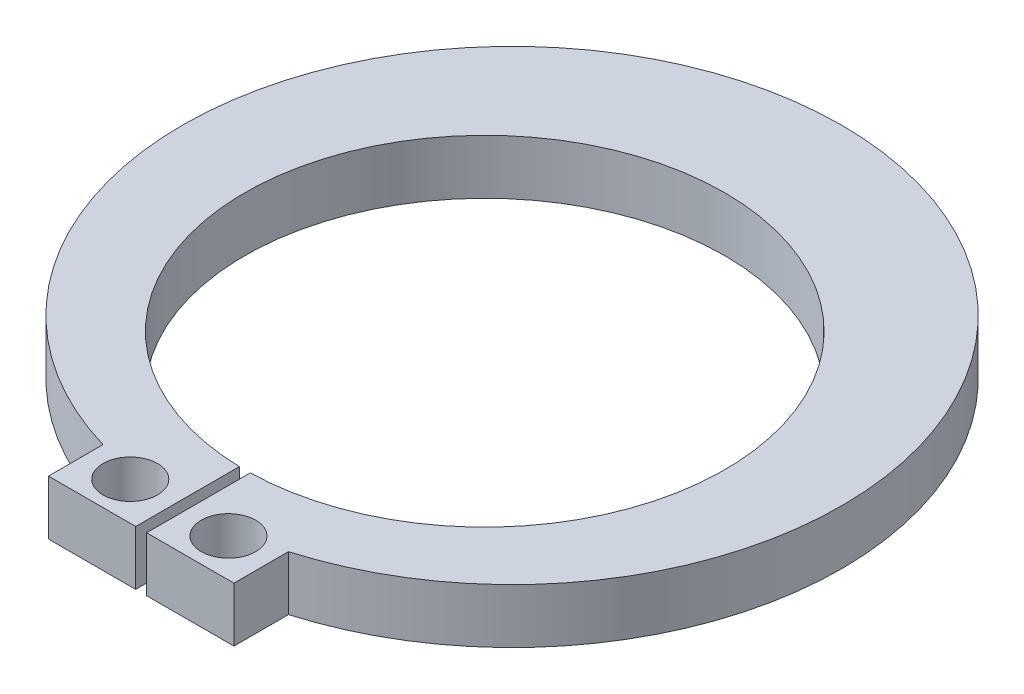
ISO-10303-21;
HEADER;
FILE_DESCRIPTION(('STEP AP214'),'2;1');
FILE_NAME('part.step','',(''),(''),'','','');
FILE_SCHEMA(('AUTOMOTIVE_DESIGN { 1 0 10303 214 1 1 1 1 }'));
ENDSEC;
DATA;
#1=APPLICATION_CONTEXT('core data for automotive mechanical design processes');
#2=APPLICATION_PROTOCOL_DEFINITION('international standard','automotive_design',2000,#1);
#3=PRODUCT_CONTEXT('',#1,'mechanical');
#4=PRODUCT('Part','Part','',(#3));
#5=PRODUCT_RELATED_PRODUCT_CATEGORY('part','',(#4));
#6=PRODUCT_DEFINITION_FORMATION('','',#4);
#7=PRODUCT_DEFINITION_CONTEXT('part definition',#1,'design');
#8=PRODUCT_DEFINITION('design','',#6,#7);
#9=PRODUCT_DEFINITION_SHAPE('','',#8);
#10=(LENGTH_UNIT() NAMED_UNIT(*) SI_UNIT(.MILLI.,.METRE.));
#11=(NAMED_UNIT(*) PLANE_ANGLE_UNIT() SI_UNIT($,.RADIAN.));
#12=(NAMED_UNIT(*) SI_UNIT($,.STERADIAN.) SOLID_ANGLE_UNIT());
#13=UNCERTAINTY_MEASURE_WITH_UNIT(LENGTH_MEASURE(1.E-05),#10,'distance_accuracy_value','');
#14=(GEOMETRIC_REPRESENTATION_CONTEXT(3) GLOBAL_UNCERTAINTY_ASSIGNED_CONTEXT((#13)) GLOBAL_UNIT_ASSIGNED_CONTEXT((#10,
#11,#12)) REPRESENTATION_CONTEXT('',''));
#15=CARTESIAN_POINT('',(0.,0.,0.));
#16=DIRECTION('',(0.,0.,1.));
#17=DIRECTION('',(1.,0.,0.));
#18=AXIS2_PLACEMENT_3D('',#15,#16,#17);
#19=CARTESIAN_POINT('',(0.,1.,0.));
#20=DIRECTION('',(0.,1.,0.));
#21=DIRECTION('',(0.,0.,1.));
#22=AXIS2_PLACEMENT_3D('',#19,#20,#21);
#23=PLANE('',#22);
#24=CARTESIAN_POINT('',(-0.9,1.,6.1));
#25=DIRECTION('',(0.,1.,0.));
#26=DIRECTION('',(0.,0.,1.));
#27=AXIS2_PLACEMENT_3D('',#24,#25,#26);
#28=CIRCLE('',#27,0.5);
#29=CARTESIAN_POINT('',(-0.9,1.,6.6));
#30=VERTEX_POINT('',#29);
#31=EDGE_CURVE('E133',#30,#30,#28,.T.);
#32=ORIENTED_EDGE('',*,*,#31,.F.);
#33=EDGE_LOOP('',(#32));
#34=FACE_BOUND('',#33,.T.);
#35=DIRECTION('',(0.,0.,1.));
#36=VECTOR('',#35,1.);
#37=CARTESIAN_POINT('',(-1.7,1.,6.8));
#38=LINE('',#37,#36);
#39=CARTESIAN_POINT('',(-1.7,1.,5.8));
#40=VERTEX_POINT('',#39);
#41=CARTESIAN_POINT('',(-1.7,1.,6.8));
#42=VERTEX_POINT('',#41);
#43=EDGE_CURVE('E144',#40,#42,#38,.T.);
#44=ORIENTED_EDGE('',*,*,#43,.T.);
#45=DIRECTION('',(1.,0.,0.));
#46=VECTOR('',#45,1.);
#47=CARTESIAN_POINT('',(-1.7,1.,6.8));
#48=LINE('',#47,#46);
#49=CARTESIAN_POINT('',(-0.1,1.,6.8));
#50=VERTEX_POINT('',#49);
#51=EDGE_CURVE('E92',#42,#50,#48,.T.);
#52=ORIENTED_EDGE('',*,*,#51,.T.);
#53=DIRECTION('',(0.,0.,-1.));
#54=VECTOR('',#53,1.);
#55=CARTESIAN_POINT('',(-0.1,1.,6.8));
#56=LINE('',#55,#54);
#57=CARTESIAN_POINT('',(-0.1,1.,4.89886348958455));
#58=VERTEX_POINT('',#57);
#59=EDGE_CURVE('E159',#50,#58,#56,.T.);
#60=ORIENTED_EDGE('',*,*,#59,.T.);
#61=CARTESIAN_POINT('',(0.,1.,0.5));
#62=DIRECTION('',(0.,-1.,0.));
#63=DIRECTION('',(0.,0.,1.));
#64=AXIS2_PLACEMENT_3D('',#61,#62,#63);
#65=CIRCLE('',#64,4.4);
#66=CARTESIAN_POINT('',(0.1,1.,4.89886348958456));
#67=VERTEX_POINT('',#66);
#68=EDGE_CURVE('E172',#58,#67,#65,.T.);
#69=ORIENTED_EDGE('',*,*,#68,.T.);
#70=DIRECTION('',(0.,0.,1.));
#71=VECTOR('',#70,1.);
#72=CARTESIAN_POINT('',(0.1,1.,6.8));
#73=LINE('',#72,#71);
#74=CARTESIAN_POINT('',(0.1,1.,6.8));
#75=VERTEX_POINT('',#74);
#76=EDGE_CURVE('E111',#67,#75,#73,.T.);
#77=ORIENTED_EDGE('',*,*,#76,.T.);
#78=DIRECTION('',(1.,0.,0.));
#79=VECTOR('',#78,1.);
#80=CARTESIAN_POINT('',(0.1,1.,6.8));
#81=LINE('',#80,#79);
#82=CARTESIAN_POINT('',(1.7,1.,6.8));
#83=VERTEX_POINT('',#82);
#84=EDGE_CURVE('E105',#75,#83,#81,.T.);
#85=ORIENTED_EDGE('',*,*,#84,.T.);
#86=DIRECTION('',(0.,0.,-1.));
#87=VECTOR('',#86,1.);
#88=CARTESIAN_POINT('',(1.7,1.,6.8));
#89=LINE('',#88,#87);
#90=CARTESIAN_POINT('',(1.7,1.,5.8));
#91=VERTEX_POINT('',#90);
#92=EDGE_CURVE('E109',#83,#91,#89,.T.);
#93=ORIENTED_EDGE('',*,*,#92,.T.);
#94=CARTESIAN_POINT('',(0.,1.,0.));
#95=DIRECTION('',(0.,1.,0.));
#96=DIRECTION('',(0.,0.,1.));
#97=AXIS2_PLACEMENT_3D('',#94,#95,#96);
#98=CIRCLE('',#97,6.04400529450463);
#99=EDGE_CURVE('E49',#91,#40,#98,.T.);
#100=ORIENTED_EDGE('',*,*,#99,.T.);
#101=EDGE_LOOP('',(#44,#52,#60,#69,#77,#85,#93,#100));
#102=FACE_BOUND('',#101,.T.);
#103=CARTESIAN_POINT('',(0.9,1.,6.1));
#104=DIRECTION('',(0.,1.,0.));
#105=DIRECTION('',(0.,0.,-1.));
#106=AXIS2_PLACEMENT_3D('',#103,#104,#105);
#107=CIRCLE('',#106,0.5);
#108=CARTESIAN_POINT('',(0.9,1.,5.6));
#109=VERTEX_POINT('',#108);
#110=EDGE_CURVE('E181',#109,#109,#107,.T.);
#111=ORIENTED_EDGE('',*,*,#110,.F.);
#112=EDGE_LOOP('',(#111));
#113=FACE_BOUND('',#112,.T.);
#114=ADVANCED_FACE('F32',(#34,#102,#113),#23,.T.);
#115=CARTESIAN_POINT('',(0.,0.,0.));
#116=DIRECTION('',(0.,1.,0.));
#117=DIRECTION('',(0.,0.,1.));
#118=AXIS2_PLACEMENT_3D('',#115,#116,#117);
#119=PLANE('',#118);
#120=DIRECTION('',(0.,0.,1.));
#121=VECTOR('',#120,1.);
#122=CARTESIAN_POINT('',(-1.7,0.,6.8));
#123=LINE('',#122,#121);
#124=CARTESIAN_POINT('',(-1.7,0.,5.8));
#125=VERTEX_POINT('',#124);
#126=CARTESIAN_POINT('',(-1.7,0.,6.8));
#127=VERTEX_POINT('',#126);
#128=EDGE_CURVE('E129',#125,#127,#123,.T.);
#129=ORIENTED_EDGE('',*,*,#128,.F.);
#130=CARTESIAN_POINT('',(0.,0.,0.));
#131=DIRECTION('',(0.,1.,0.));
#132=DIRECTION('',(0.,0.,1.));
#133=AXIS2_PLACEMENT_3D('',#130,#131,#132);
#134=CIRCLE('',#133,6.04400529450463);
#135=CARTESIAN_POINT('',(1.7,0.,5.8));
#136=VERTEX_POINT('',#135);
#137=EDGE_CURVE('E84',#136,#125,#134,.T.);
#138=ORIENTED_EDGE('',*,*,#137,.F.);
#139=DIRECTION('',(0.,0.,-1.));
#140=VECTOR('',#139,1.);
#141=CARTESIAN_POINT('',(1.7,0.,6.8));
#142=LINE('',#141,#140);
#143=CARTESIAN_POINT('',(1.7,0.,6.8));
#144=VERTEX_POINT('',#143);
#145=EDGE_CURVE('E78',#144,#136,#142,.T.);
#146=ORIENTED_EDGE('',*,*,#145,.F.);
#147=DIRECTION('',(1.,0.,0.));
#148=VECTOR('',#147,1.);
#149=CARTESIAN_POINT('',(0.1,0.,6.8));
#150=LINE('',#149,#148);
#151=CARTESIAN_POINT('',(0.1,0.,6.8));
#152=VERTEX_POINT('',#151);
#153=EDGE_CURVE('E119',#152,#144,#150,.T.);
#154=ORIENTED_EDGE('',*,*,#153,.F.);
#155=DIRECTION('',(0.,0.,1.));
#156=VECTOR('',#155,1.);
#157=CARTESIAN_POINT('',(0.1,0.,6.8));
#158=LINE('',#157,#156);
#159=CARTESIAN_POINT('',(0.1,0.,4.89886348958456));
#160=VERTEX_POINT('',#159);
#161=EDGE_CURVE('E139',#160,#152,#158,.T.);
#162=ORIENTED_EDGE('',*,*,#161,.F.);
#163=CARTESIAN_POINT('',(0.,0.,0.5));
#164=DIRECTION('',(0.,-1.,0.));
#165=DIRECTION('',(0.,0.,1.));
#166=AXIS2_PLACEMENT_3D('',#163,#164,#165);
#167=CIRCLE('',#166,4.4);
#168=CARTESIAN_POINT('',(-0.1,0.,4.89886348958455));
#169=VERTEX_POINT('',#168);
#170=EDGE_CURVE('E137',#169,#160,#167,.T.);
#171=ORIENTED_EDGE('',*,*,#170,.F.);
#172=DIRECTION('',(0.,0.,-1.));
#173=VECTOR('',#172,1.);
#174=CARTESIAN_POINT('',(-0.1,0.,6.8));
#175=LINE('',#174,#173);
#176=CARTESIAN_POINT('',(-0.1,0.,6.8));
#177=VERTEX_POINT('',#176);
#178=EDGE_CURVE('E135',#177,#169,#175,.T.);
#179=ORIENTED_EDGE('',*,*,#178,.F.);
#180=DIRECTION('',(1.,0.,0.));
#181=VECTOR('',#180,1.);
#182=CARTESIAN_POINT('',(-1.7,0.,6.8));
#183=LINE('',#182,#181);
#184=EDGE_CURVE('E132',#127,#177,#183,.T.);
#185=ORIENTED_EDGE('',*,*,#184,.F.);
#186=EDGE_LOOP('',(#129,#138,#146,#154,#162,#171,#179,#185));
#187=FACE_BOUND('',#186,.T.);
#188=CARTESIAN_POINT('',(-0.9,0.,6.1));
#189=DIRECTION('',(0.,1.,0.));
#190=DIRECTION('',(0.,0.,1.));
#191=AXIS2_PLACEMENT_3D('',#188,#189,#190);
#192=CIRCLE('',#191,0.5);
#193=CARTESIAN_POINT('',(-0.9,0.,6.6));
#194=VERTEX_POINT('',#193);
#195=EDGE_CURVE('E178',#194,#194,#192,.T.);
#196=ORIENTED_EDGE('',*,*,#195,.T.);
#197=EDGE_LOOP('',(#196));
#198=FACE_BOUND('',#197,.T.);
#199=CARTESIAN_POINT('',(0.9,0.,6.1));
#200=DIRECTION('',(0.,1.,0.));
#201=DIRECTION('',(0.,0.,-1.));
#202=AXIS2_PLACEMENT_3D('',#199,#200,#201);
#203=CIRCLE('',#202,0.5);
#204=CARTESIAN_POINT('',(0.9,0.,5.6));
#205=VERTEX_POINT('',#204);
#206=EDGE_CURVE('E184',#205,#205,#203,.T.);
#207=ORIENTED_EDGE('',*,*,#206,.T.);
#208=EDGE_LOOP('',(#207));
#209=FACE_BOUND('',#208,.T.);
#210=ADVANCED_FACE('F163',(#187,#198,#209),#119,.F.);
#211=CARTESIAN_POINT('',(-1.7,1.,6.8));
#212=DIRECTION('',(1.,0.,0.));
#213=DIRECTION('',(0.,0.,-1.));
#214=AXIS2_PLACEMENT_3D('',#211,#212,#213);
#215=PLANE('',#214);
#216=ORIENTED_EDGE('',*,*,#128,.T.);
#217=DIRECTION('',(0.,-1.,0.));
#218=VECTOR('',#217,1.);
#219=CARTESIAN_POINT('',(-1.7,1.,6.8));
#220=LINE('',#219,#218);
#221=EDGE_CURVE('E11',#42,#127,#220,.T.);
#222=ORIENTED_EDGE('',*,*,#221,.F.);
#223=ORIENTED_EDGE('',*,*,#43,.F.);
#224=DIRECTION('',(0.,-1.,0.));
#225=VECTOR('',#224,1.);
#226=CARTESIAN_POINT('',(-1.7,1.,5.8));
#227=LINE('',#226,#225);
#228=EDGE_CURVE('E125',#40,#125,#227,.T.);
#229=ORIENTED_EDGE('',*,*,#228,.T.);
#230=EDGE_LOOP('',(#216,#222,#223,#229));
#231=FACE_BOUND('',#230,.T.);
#232=ADVANCED_FACE('F34',(#231),#215,.F.);
#233=CARTESIAN_POINT('',(-1.7,1.,6.8));
#234=DIRECTION('',(0.,0.,-1.));
#235=DIRECTION('',(-1.,0.,0.));
#236=AXIS2_PLACEMENT_3D('',#233,#234,#235);
#237=PLANE('',#236);
#238=ORIENTED_EDGE('',*,*,#184,.T.);
#239=DIRECTION('',(0.,-1.,0.));
#240=VECTOR('',#239,1.);
#241=CARTESIAN_POINT('',(-0.1,1.,6.8));
#242=LINE('',#241,#240);
#243=EDGE_CURVE('E41',#50,#177,#242,.T.);
#244=ORIENTED_EDGE('',*,*,#243,.F.);
#245=ORIENTED_EDGE('',*,*,#51,.F.);
#246=ORIENTED_EDGE('',*,*,#221,.T.);
#247=EDGE_LOOP('',(#238,#244,#245,#246));
#248=FACE_BOUND('',#247,.T.);
#249=ADVANCED_FACE('F216',(#248),#237,.F.);
#250=CARTESIAN_POINT('',(-0.1,1.,6.8));
#251=DIRECTION('',(-1.,0.,0.));
#252=DIRECTION('',(0.,0.,1.));
#253=AXIS2_PLACEMENT_3D('',#250,#251,#252);
#254=PLANE('',#253);
#255=ORIENTED_EDGE('',*,*,#178,.T.);
#256=DIRECTION('',(0.,-1.,0.));
#257=VECTOR('',#256,1.);
#258=CARTESIAN_POINT('',(-0.1,1.,4.89886348958455));
#259=LINE('',#258,#257);
#260=EDGE_CURVE('E151',#58,#169,#259,.T.);
#261=ORIENTED_EDGE('',*,*,#260,.F.);
#262=ORIENTED_EDGE('',*,*,#59,.F.);
#263=ORIENTED_EDGE('',*,*,#243,.T.);
#264=EDGE_LOOP('',(#255,#261,#262,#263));
#265=FACE_BOUND('',#264,.T.);
#266=ADVANCED_FACE('F157',(#265),#254,.F.);
#267=CARTESIAN_POINT('',(0.,1.,0.5));
#268=DIRECTION('',(0.,-1.,0.));
#269=DIRECTION('',(0.,0.,-1.));
#270=AXIS2_PLACEMENT_3D('',#267,#268,#269);
#271=CYLINDRICAL_SURFACE('',#270,4.4);
#272=ORIENTED_EDGE('',*,*,#170,.T.);
#273=DIRECTION('',(0.,-1.,0.));
#274=VECTOR('',#273,1.);
#275=CARTESIAN_POINT('',(0.1,1.,4.89886348958456));
#276=LINE('',#275,#274);
#277=EDGE_CURVE('E148',#67,#160,#276,.T.);
#278=ORIENTED_EDGE('',*,*,#277,.F.);
#279=ORIENTED_EDGE('',*,*,#68,.F.);
#280=ORIENTED_EDGE('',*,*,#260,.T.);
#281=EDGE_LOOP('',(#272,#278,#279,#280));
#282=FACE_BOUND('',#281,.T.);
#283=ADVANCED_FACE('F168',(#282),#271,.F.);
#284=CARTESIAN_POINT('',(0.1,1.,6.8));
#285=DIRECTION('',(1.,0.,0.));
#286=DIRECTION('',(0.,0.,-1.));
#287=AXIS2_PLACEMENT_3D('',#284,#285,#286);
#288=PLANE('',#287);
#289=ORIENTED_EDGE('',*,*,#161,.T.);
#290=DIRECTION('',(0.,-1.,0.));
#291=VECTOR('',#290,1.);
#292=CARTESIAN_POINT('',(0.1,1.,6.8));
#293=LINE('',#292,#291);
#294=EDGE_CURVE('E120',#75,#152,#293,.T.);
#295=ORIENTED_EDGE('',*,*,#294,.F.);
#296=ORIENTED_EDGE('',*,*,#76,.F.);
#297=ORIENTED_EDGE('',*,*,#277,.T.);
#298=EDGE_LOOP('',(#289,#295,#296,#297));
#299=FACE_BOUND('',#298,.T.);
#300=ADVANCED_FACE('F171',(#299),#288,.F.);
#301=CARTESIAN_POINT('',(0.1,1.,6.8));
#302=DIRECTION('',(0.,0.,-1.));
#303=DIRECTION('',(-1.,0.,0.));
#304=AXIS2_PLACEMENT_3D('',#301,#302,#303);
#305=PLANE('',#304);
#306=ORIENTED_EDGE('',*,*,#153,.T.);
#307=DIRECTION('',(0.,-1.,0.));
#308=VECTOR('',#307,1.);
#309=CARTESIAN_POINT('',(1.7,1.,6.8));
#310=LINE('',#309,#308);
#311=EDGE_CURVE('E116',#83,#144,#310,.T.);
#312=ORIENTED_EDGE('',*,*,#311,.F.);
#313=ORIENTED_EDGE('',*,*,#84,.F.);
#314=ORIENTED_EDGE('',*,*,#294,.T.);
#315=EDGE_LOOP('',(#306,#312,#313,#314));
#316=FACE_BOUND('',#315,.T.);
#317=ADVANCED_FACE('F117',(#316),#305,.F.);
#318=CARTESIAN_POINT('',(1.7,1.,6.8));
#319=DIRECTION('',(-1.,0.,0.));
#320=DIRECTION('',(0.,0.,1.));
#321=AXIS2_PLACEMENT_3D('',#318,#319,#320);
#322=PLANE('',#321);
#323=ORIENTED_EDGE('',*,*,#145,.T.);
#324=DIRECTION('',(0.,-1.,0.));
#325=VECTOR('',#324,1.);
#326=CARTESIAN_POINT('',(1.7,1.,5.8));
#327=LINE('',#326,#325);
#328=EDGE_CURVE('E121',#91,#136,#327,.T.);
#329=ORIENTED_EDGE('',*,*,#328,.F.);
#330=ORIENTED_EDGE('',*,*,#92,.F.);
#331=ORIENTED_EDGE('',*,*,#311,.T.);
#332=EDGE_LOOP('',(#323,#329,#330,#331));
#333=FACE_BOUND('',#332,.T.);
#334=ADVANCED_FACE('F123',(#333),#322,.F.);
#335=CARTESIAN_POINT('',(0.,1.,0.));
#336=DIRECTION('',(0.,-1.,0.));
#337=DIRECTION('',(0.,0.,-1.));
#338=AXIS2_PLACEMENT_3D('',#335,#336,#337);
#339=CYLINDRICAL_SURFACE('',#338,6.04400529450463);
#340=ORIENTED_EDGE('',*,*,#137,.T.);
#341=ORIENTED_EDGE('',*,*,#228,.F.);
#342=ORIENTED_EDGE('',*,*,#99,.F.);
#343=ORIENTED_EDGE('',*,*,#328,.T.);
#344=EDGE_LOOP('',(#340,#341,#342,#343));
#345=FACE_BOUND('',#344,.T.);
#346=ADVANCED_FACE('F204',(#345),#339,.T.);
#347=CARTESIAN_POINT('',(-0.9,1.,6.1));
#348=DIRECTION('',(0.,-1.,0.));
#349=DIRECTION('',(0.,0.,-1.));
#350=AXIS2_PLACEMENT_3D('',#347,#348,#349);
#351=CYLINDRICAL_SURFACE('',#350,0.5);
#352=ORIENTED_EDGE('',*,*,#31,.T.);
#353=EDGE_LOOP('',(#352));
#354=FACE_BOUND('',#353,.T.);
#355=ORIENTED_EDGE('',*,*,#195,.F.);
#356=EDGE_LOOP('',(#355));
#357=FACE_BOUND('',#356,.T.);
#358=ADVANCED_FACE('F201',(#354,#357),#351,.F.);
#359=CARTESIAN_POINT('',(0.9,1.,6.1));
#360=DIRECTION('',(0.,-1.,0.));
#361=DIRECTION('',(0.,0.,-1.));
#362=AXIS2_PLACEMENT_3D('',#359,#360,#361);
#363=CYLINDRICAL_SURFACE('',#362,0.5);
#364=ORIENTED_EDGE('',*,*,#110,.T.);
#365=EDGE_LOOP('',(#364));
#366=FACE_BOUND('',#365,.T.);
#367=ORIENTED_EDGE('',*,*,#206,.F.);
#368=EDGE_LOOP('',(#367));
#369=FACE_BOUND('',#368,.T.);
#370=ADVANCED_FACE('F190',(#366,#369),#363,.F.);
#371=CLOSED_SHELL('',(#114,#210,#232,#249,#266,#283,#300,#317,#334,#346,#358,#370));
#372=MANIFOLD_SOLID_BREP('B2',#371);
#373=ADVANCED_BREP_SHAPE_REPRESENTATION('',(#18,#372),#14);
#374=SHAPE_DEFINITION_REPRESENTATION(#9,#373);
ENDSEC;
END-ISO-10303-21;
